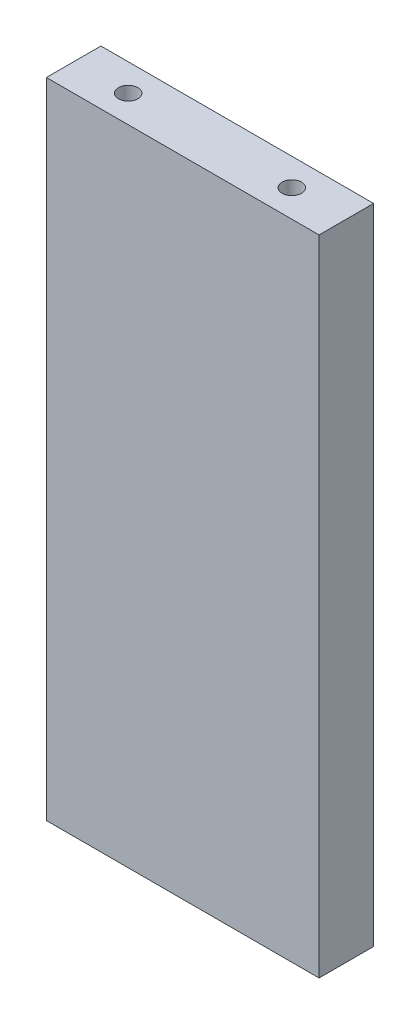
ISO-10303-21;
HEADER;
FILE_DESCRIPTION(('STEP AP214'),'2;1');
FILE_NAME('part.step','',(''),(''),'','','');
FILE_SCHEMA(('AUTOMOTIVE_DESIGN { 1 0 10303 214 1 1 1 1 }'));
ENDSEC;
DATA;
#1=APPLICATION_CONTEXT('core data for automotive mechanical design processes');
#2=APPLICATION_PROTOCOL_DEFINITION('international standard','automotive_design',2000,#1);
#3=PRODUCT_CONTEXT('',#1,'mechanical');
#4=PRODUCT('Part','Part','',(#3));
#5=PRODUCT_RELATED_PRODUCT_CATEGORY('part','',(#4));
#6=PRODUCT_DEFINITION_FORMATION('','',#4);
#7=PRODUCT_DEFINITION_CONTEXT('part definition',#1,'design');
#8=PRODUCT_DEFINITION('design','',#6,#7);
#9=PRODUCT_DEFINITION_SHAPE('','',#8);
#10=(LENGTH_UNIT() NAMED_UNIT(*) SI_UNIT(.MILLI.,.METRE.));
#11=(NAMED_UNIT(*) PLANE_ANGLE_UNIT() SI_UNIT($,.RADIAN.));
#12=(NAMED_UNIT(*) SI_UNIT($,.STERADIAN.) SOLID_ANGLE_UNIT());
#13=UNCERTAINTY_MEASURE_WITH_UNIT(LENGTH_MEASURE(1.E-05),#10,'distance_accuracy_value','');
#14=(GEOMETRIC_REPRESENTATION_CONTEXT(3) GLOBAL_UNCERTAINTY_ASSIGNED_CONTEXT((#13)) GLOBAL_UNIT_ASSIGNED_CONTEXT((#10,
#11,#12)) REPRESENTATION_CONTEXT('',''));
#15=CARTESIAN_POINT('',(0.,0.,0.));
#16=DIRECTION('',(0.,0.,1.));
#17=DIRECTION('',(1.,0.,0.));
#18=AXIS2_PLACEMENT_3D('',#15,#16,#17);
#19=CARTESIAN_POINT('',(-15.875,74.93,-3.175));
#20=DIRECTION('',(1.,0.,0.));
#21=DIRECTION('',(0.,0.,-1.));
#22=AXIS2_PLACEMENT_3D('',#19,#20,#21);
#23=PLANE('',#22);
#24=DIRECTION('',(0.,0.,1.));
#25=VECTOR('',#24,1.);
#26=CARTESIAN_POINT('',(-15.875,0.,-3.175));
#27=LINE('',#26,#25);
#28=CARTESIAN_POINT('',(-15.875,0.,-3.175));
#29=VERTEX_POINT('',#28);
#30=CARTESIAN_POINT('',(-15.875,0.,3.175));
#31=VERTEX_POINT('',#30);
#32=EDGE_CURVE('E130',#29,#31,#27,.T.);
#33=ORIENTED_EDGE('',*,*,#32,.T.);
#34=DIRECTION('',(0.,-1.,0.));
#35=VECTOR('',#34,1.);
#36=CARTESIAN_POINT('',(-15.875,74.93,3.175));
#37=LINE('',#36,#35);
#38=CARTESIAN_POINT('',(-15.875,74.93,3.175));
#39=VERTEX_POINT('',#38);
#40=EDGE_CURVE('E11',#39,#31,#37,.T.);
#41=ORIENTED_EDGE('',*,*,#40,.F.);
#42=DIRECTION('',(0.,0.,1.));
#43=VECTOR('',#42,1.);
#44=CARTESIAN_POINT('',(-15.875,74.93,-3.175));
#45=LINE('',#44,#43);
#46=CARTESIAN_POINT('',(-15.875,74.93,-3.175));
#47=VERTEX_POINT('',#46);
#48=EDGE_CURVE('E131',#47,#39,#45,.T.);
#49=ORIENTED_EDGE('',*,*,#48,.F.);
#50=DIRECTION('',(0.,-1.,0.));
#51=VECTOR('',#50,1.);
#52=CARTESIAN_POINT('',(-15.875,74.93,-3.175));
#53=LINE('',#52,#51);
#54=EDGE_CURVE('E137',#47,#29,#53,.T.);
#55=ORIENTED_EDGE('',*,*,#54,.T.);
#56=EDGE_LOOP('',(#33,#41,#49,#55));
#57=FACE_BOUND('',#56,.T.);
#58=ADVANCED_FACE('F37',(#57),#23,.F.);
#59=CARTESIAN_POINT('',(15.875,74.93,3.175));
#60=DIRECTION('',(0.,0.,-1.));
#61=DIRECTION('',(-1.,0.,0.));
#62=AXIS2_PLACEMENT_3D('',#59,#60,#61);
#63=PLANE('',#62);
#64=DIRECTION('',(1.,0.,0.));
#65=VECTOR('',#64,1.);
#66=CARTESIAN_POINT('',(15.875,0.,3.175));
#67=LINE('',#66,#65);
#68=CARTESIAN_POINT('',(15.875,0.,3.175));
#69=VERTEX_POINT('',#68);
#70=EDGE_CURVE('E140',#31,#69,#67,.T.);
#71=ORIENTED_EDGE('',*,*,#70,.T.);
#72=DIRECTION('',(0.,-1.,0.));
#73=VECTOR('',#72,1.);
#74=CARTESIAN_POINT('',(15.875,74.93,3.175));
#75=LINE('',#74,#73);
#76=CARTESIAN_POINT('',(15.875,74.93,3.175));
#77=VERTEX_POINT('',#76);
#78=EDGE_CURVE('E45',#77,#69,#75,.T.);
#79=ORIENTED_EDGE('',*,*,#78,.F.);
#80=DIRECTION('',(1.,0.,0.));
#81=VECTOR('',#80,1.);
#82=CARTESIAN_POINT('',(15.875,74.93,3.175));
#83=LINE('',#82,#81);
#84=EDGE_CURVE('E84',#39,#77,#83,.T.);
#85=ORIENTED_EDGE('',*,*,#84,.F.);
#86=ORIENTED_EDGE('',*,*,#40,.T.);
#87=EDGE_LOOP('',(#71,#79,#85,#86));
#88=FACE_BOUND('',#87,.T.);
#89=ADVANCED_FACE('F164',(#88),#63,.F.);
#90=CARTESIAN_POINT('',(15.875,74.93,-3.175));
#91=DIRECTION('',(-1.,0.,0.));
#92=DIRECTION('',(0.,0.,1.));
#93=AXIS2_PLACEMENT_3D('',#90,#91,#92);
#94=PLANE('',#93);
#95=DIRECTION('',(0.,0.,-1.));
#96=VECTOR('',#95,1.);
#97=CARTESIAN_POINT('',(15.875,0.,-3.175));
#98=LINE('',#97,#96);
#99=CARTESIAN_POINT('',(15.875,0.,-3.175));
#100=VERTEX_POINT('',#99);
#101=EDGE_CURVE('E71',#69,#100,#98,.T.);
#102=ORIENTED_EDGE('',*,*,#101,.T.);
#103=DIRECTION('',(0.,-1.,0.));
#104=VECTOR('',#103,1.);
#105=CARTESIAN_POINT('',(15.875,74.93,-3.175));
#106=LINE('',#105,#104);
#107=CARTESIAN_POINT('',(15.875,74.93,-3.175));
#108=VERTEX_POINT('',#107);
#109=EDGE_CURVE('E145',#108,#100,#106,.T.);
#110=ORIENTED_EDGE('',*,*,#109,.F.);
#111=DIRECTION('',(0.,0.,-1.));
#112=VECTOR('',#111,1.);
#113=CARTESIAN_POINT('',(15.875,74.93,-3.175));
#114=LINE('',#113,#112);
#115=EDGE_CURVE('E134',#77,#108,#114,.T.);
#116=ORIENTED_EDGE('',*,*,#115,.F.);
#117=ORIENTED_EDGE('',*,*,#78,.T.);
#118=EDGE_LOOP('',(#102,#110,#116,#117));
#119=FACE_BOUND('',#118,.T.);
#120=ADVANCED_FACE('F147',(#119),#94,.F.);
#121=CARTESIAN_POINT('',(15.875,74.93,-3.175));
#122=DIRECTION('',(0.,0.,1.));
#123=DIRECTION('',(1.,0.,0.));
#124=AXIS2_PLACEMENT_3D('',#121,#122,#123);
#125=PLANE('',#124);
#126=DIRECTION('',(-1.,0.,0.));
#127=VECTOR('',#126,1.);
#128=CARTESIAN_POINT('',(15.875,0.,-3.175));
#129=LINE('',#128,#127);
#130=EDGE_CURVE('E77',#100,#29,#129,.T.);
#131=ORIENTED_EDGE('',*,*,#130,.T.);
#132=ORIENTED_EDGE('',*,*,#54,.F.);
#133=DIRECTION('',(-1.,0.,0.));
#134=VECTOR('',#133,1.);
#135=CARTESIAN_POINT('',(15.875,74.93,-3.175));
#136=LINE('',#135,#134);
#137=EDGE_CURVE('E53',#108,#47,#136,.T.);
#138=ORIENTED_EDGE('',*,*,#137,.F.);
#139=ORIENTED_EDGE('',*,*,#109,.T.);
#140=EDGE_LOOP('',(#131,#132,#138,#139));
#141=FACE_BOUND('',#140,.T.);
#142=ADVANCED_FACE('F154',(#141),#125,.F.);
#143=CARTESIAN_POINT('',(0.,74.93,0.));
#144=DIRECTION('',(0.,-1.,0.));
#145=DIRECTION('',(0.,0.,-1.));
#146=AXIS2_PLACEMENT_3D('',#143,#144,#145);
#147=PLANE('',#146);
#148=CARTESIAN_POINT('',(-9.525,74.93,0.));
#149=DIRECTION('',(0.,1.,0.));
#150=DIRECTION('',(0.,0.,1.));
#151=AXIS2_PLACEMENT_3D('',#148,#149,#150);
#152=CIRCLE('',#151,1.1303);
#153=CARTESIAN_POINT('',(-9.525,74.93,1.1303));
#154=VERTEX_POINT('',#153);
#155=EDGE_CURVE('E108',#154,#154,#152,.T.);
#156=ORIENTED_EDGE('',*,*,#155,.F.);
#157=EDGE_LOOP('',(#156));
#158=FACE_BOUND('',#157,.T.);
#159=CARTESIAN_POINT('',(9.525,74.93,0.));
#160=DIRECTION('',(0.,1.,0.));
#161=DIRECTION('',(0.,0.,1.));
#162=AXIS2_PLACEMENT_3D('',#159,#160,#161);
#163=CIRCLE('',#162,1.1303);
#164=CARTESIAN_POINT('',(9.525,74.93,1.1303));
#165=VERTEX_POINT('',#164);
#166=EDGE_CURVE('E107',#165,#165,#163,.T.);
#167=ORIENTED_EDGE('',*,*,#166,.F.);
#168=EDGE_LOOP('',(#167));
#169=FACE_BOUND('',#168,.T.);
#170=ORIENTED_EDGE('',*,*,#48,.T.);
#171=ORIENTED_EDGE('',*,*,#84,.T.);
#172=ORIENTED_EDGE('',*,*,#115,.T.);
#173=ORIENTED_EDGE('',*,*,#137,.T.);
#174=EDGE_LOOP('',(#170,#171,#172,#173));
#175=FACE_BOUND('',#174,.T.);
#176=ADVANCED_FACE('F156',(#158,#169,#175),#147,.F.);
#177=CARTESIAN_POINT('',(0.,0.,0.));
#178=DIRECTION('',(0.,-1.,0.));
#179=DIRECTION('',(0.,0.,-1.));
#180=AXIS2_PLACEMENT_3D('',#177,#178,#179);
#181=PLANE('',#180);
#182=CARTESIAN_POINT('',(-9.525,0.,0.));
#183=DIRECTION('',(0.,-1.,0.));
#184=DIRECTION('',(0.,0.,-1.));
#185=AXIS2_PLACEMENT_3D('',#182,#183,#184);
#186=CIRCLE('',#185,1.1303);
#187=CARTESIAN_POINT('',(-9.525,0.,-1.1303));
#188=VERTEX_POINT('',#187);
#189=EDGE_CURVE('E118',#188,#188,#186,.T.);
#190=ORIENTED_EDGE('',*,*,#189,.F.);
#191=EDGE_LOOP('',(#190));
#192=FACE_BOUND('',#191,.T.);
#193=CARTESIAN_POINT('',(9.525,0.,0.));
#194=DIRECTION('',(0.,-1.,0.));
#195=DIRECTION('',(0.,0.,-1.));
#196=AXIS2_PLACEMENT_3D('',#193,#194,#195);
#197=CIRCLE('',#196,1.1303);
#198=CARTESIAN_POINT('',(9.525,0.,-1.1303));
#199=VERTEX_POINT('',#198);
#200=EDGE_CURVE('E124',#199,#199,#197,.T.);
#201=ORIENTED_EDGE('',*,*,#200,.F.);
#202=EDGE_LOOP('',(#201));
#203=FACE_BOUND('',#202,.T.);
#204=ORIENTED_EDGE('',*,*,#32,.F.);
#205=ORIENTED_EDGE('',*,*,#130,.F.);
#206=ORIENTED_EDGE('',*,*,#101,.F.);
#207=ORIENTED_EDGE('',*,*,#70,.F.);
#208=EDGE_LOOP('',(#204,#205,#206,#207));
#209=FACE_BOUND('',#208,.T.);
#210=ADVANCED_FACE('F150',(#192,#203,#209),#181,.T.);
#211=CARTESIAN_POINT('',(9.525,7.5946,0.));
#212=DIRECTION('',(0.,-1.,0.));
#213=DIRECTION('',(0.,0.,-1.));
#214=AXIS2_PLACEMENT_3D('',#211,#212,#213);
#215=CONICAL_SURFACE('',#214,1.1303,1.02974425867665);
#216=CARTESIAN_POINT('',(9.525,8.27375275768685,0.));
#217=VERTEX_POINT('',#216);
#218=VERTEX_LOOP('',#217);
#219=FACE_BOUND('',#218,.T.);
#220=CARTESIAN_POINT('',(9.525,7.5946,0.));
#221=DIRECTION('',(0.,-1.,0.));
#222=DIRECTION('',(0.,0.,-1.));
#223=AXIS2_PLACEMENT_3D('',#220,#221,#222);
#224=CIRCLE('',#223,1.1303);
#225=CARTESIAN_POINT('',(9.525,7.5946,-1.1303));
#226=VERTEX_POINT('',#225);
#227=EDGE_CURVE('E127',#226,#226,#224,.T.);
#228=ORIENTED_EDGE('',*,*,#227,.T.);
#229=EDGE_LOOP('',(#228));
#230=FACE_BOUND('',#229,.T.);
#231=ADVANCED_FACE('F191',(#219,#230),#215,.F.);
#232=CARTESIAN_POINT('',(9.525,0.,0.));
#233=DIRECTION('',(0.,-1.,0.));
#234=DIRECTION('',(0.,0.,-1.));
#235=AXIS2_PLACEMENT_3D('',#232,#233,#234);
#236=CYLINDRICAL_SURFACE('',#235,1.1303);
#237=ORIENTED_EDGE('',*,*,#227,.F.);
#238=EDGE_LOOP('',(#237));
#239=FACE_BOUND('',#238,.T.);
#240=ORIENTED_EDGE('',*,*,#200,.T.);
#241=EDGE_LOOP('',(#240));
#242=FACE_BOUND('',#241,.T.);
#243=ADVANCED_FACE('F200',(#239,#242),#236,.F.);
#244=CARTESIAN_POINT('',(-9.525,7.5946,0.));
#245=DIRECTION('',(0.,-1.,0.));
#246=DIRECTION('',(0.,0.,-1.));
#247=AXIS2_PLACEMENT_3D('',#244,#245,#246);
#248=CONICAL_SURFACE('',#247,1.1303,1.02974425867665);
#249=CARTESIAN_POINT('',(-9.525,8.27375275768685,0.));
#250=VERTEX_POINT('',#249);
#251=VERTEX_LOOP('',#250);
#252=FACE_BOUND('',#251,.T.);
#253=CARTESIAN_POINT('',(-9.525,7.5946,0.));
#254=DIRECTION('',(0.,-1.,0.));
#255=DIRECTION('',(0.,0.,-1.));
#256=AXIS2_PLACEMENT_3D('',#253,#254,#255);
#257=CIRCLE('',#256,1.1303);
#258=CARTESIAN_POINT('',(-9.525,7.5946,-1.1303));
#259=VERTEX_POINT('',#258);
#260=EDGE_CURVE('E121',#259,#259,#257,.T.);
#261=ORIENTED_EDGE('',*,*,#260,.T.);
#262=EDGE_LOOP('',(#261));
#263=FACE_BOUND('',#262,.T.);
#264=ADVANCED_FACE('F211',(#252,#263),#248,.F.);
#265=CARTESIAN_POINT('',(-9.525,0.,0.));
#266=DIRECTION('',(0.,-1.,0.));
#267=DIRECTION('',(0.,0.,-1.));
#268=AXIS2_PLACEMENT_3D('',#265,#266,#267);
#269=CYLINDRICAL_SURFACE('',#268,1.1303);
#270=ORIENTED_EDGE('',*,*,#260,.F.);
#271=EDGE_LOOP('',(#270));
#272=FACE_BOUND('',#271,.T.);
#273=ORIENTED_EDGE('',*,*,#189,.T.);
#274=EDGE_LOOP('',(#273));
#275=FACE_BOUND('',#274,.T.);
#276=ADVANCED_FACE('F223',(#272,#275),#269,.F.);
#277=CARTESIAN_POINT('',(9.525,67.3354,0.));
#278=DIRECTION('',(0.,1.,0.));
#279=DIRECTION('',(0.,0.,1.));
#280=AXIS2_PLACEMENT_3D('',#277,#278,#279);
#281=CONICAL_SURFACE('',#280,1.1303,1.02974425867666);
#282=CARTESIAN_POINT('',(9.525,66.6562472423131,0.));
#283=VERTEX_POINT('',#282);
#284=VERTEX_LOOP('',#283);
#285=FACE_BOUND('',#284,.T.);
#286=CARTESIAN_POINT('',(9.525,67.3354,0.));
#287=DIRECTION('',(0.,1.,0.));
#288=DIRECTION('',(0.,0.,1.));
#289=AXIS2_PLACEMENT_3D('',#286,#287,#288);
#290=CIRCLE('',#289,1.1303);
#291=CARTESIAN_POINT('',(9.525,67.3354,1.1303));
#292=VERTEX_POINT('',#291);
#293=EDGE_CURVE('E111',#292,#292,#290,.T.);
#294=ORIENTED_EDGE('',*,*,#293,.T.);
#295=EDGE_LOOP('',(#294));
#296=FACE_BOUND('',#295,.T.);
#297=ADVANCED_FACE('F233',(#285,#296),#281,.F.);
#298=CARTESIAN_POINT('',(9.525,74.93,0.));
#299=DIRECTION('',(0.,1.,0.));
#300=DIRECTION('',(0.,0.,1.));
#301=AXIS2_PLACEMENT_3D('',#298,#299,#300);
#302=CYLINDRICAL_SURFACE('',#301,1.1303);
#303=ORIENTED_EDGE('',*,*,#293,.F.);
#304=EDGE_LOOP('',(#303));
#305=FACE_BOUND('',#304,.T.);
#306=ORIENTED_EDGE('',*,*,#166,.T.);
#307=EDGE_LOOP('',(#306));
#308=FACE_BOUND('',#307,.T.);
#309=ADVANCED_FACE('F101',(#305,#308),#302,.F.);
#310=CARTESIAN_POINT('',(-9.525,67.3354,0.));
#311=DIRECTION('',(0.,1.,0.));
#312=DIRECTION('',(0.,0.,1.));
#313=AXIS2_PLACEMENT_3D('',#310,#311,#312);
#314=CONICAL_SURFACE('',#313,1.1303,1.02974425867666);
#315=CARTESIAN_POINT('',(-9.525,66.6562472423131,0.));
#316=VERTEX_POINT('',#315);
#317=VERTEX_LOOP('',#316);
#318=FACE_BOUND('',#317,.T.);
#319=CARTESIAN_POINT('',(-9.525,67.3354,0.));
#320=DIRECTION('',(0.,1.,0.));
#321=DIRECTION('',(0.,0.,1.));
#322=AXIS2_PLACEMENT_3D('',#319,#320,#321);
#323=CIRCLE('',#322,1.1303);
#324=CARTESIAN_POINT('',(-9.525,67.3354,1.1303));
#325=VERTEX_POINT('',#324);
#326=EDGE_CURVE('E105',#325,#325,#323,.T.);
#327=ORIENTED_EDGE('',*,*,#326,.T.);
#328=EDGE_LOOP('',(#327));
#329=FACE_BOUND('',#328,.T.);
#330=ADVANCED_FACE('F97',(#318,#329),#314,.F.);
#331=CARTESIAN_POINT('',(-9.525,74.93,0.));
#332=DIRECTION('',(0.,1.,0.));
#333=DIRECTION('',(0.,0.,1.));
#334=AXIS2_PLACEMENT_3D('',#331,#332,#333);
#335=CYLINDRICAL_SURFACE('',#334,1.1303);
#336=ORIENTED_EDGE('',*,*,#326,.F.);
#337=EDGE_LOOP('',(#336));
#338=FACE_BOUND('',#337,.T.);
#339=ORIENTED_EDGE('',*,*,#155,.T.);
#340=EDGE_LOOP('',(#339));
#341=FACE_BOUND('',#340,.T.);
#342=ADVANCED_FACE('F100',(#338,#341),#335,.F.);
#343=CLOSED_SHELL('',(#58,#89,#120,#142,#176,#210,#231,#243,#264,#276,#297,#309,#330,#342));
#344=MANIFOLD_SOLID_BREP('B2',#343);
#345=ADVANCED_BREP_SHAPE_REPRESENTATION('',(#18,#344),#14);
#346=SHAPE_DEFINITION_REPRESENTATION(#9,#345);
ENDSEC;
END-ISO-10303-21;
